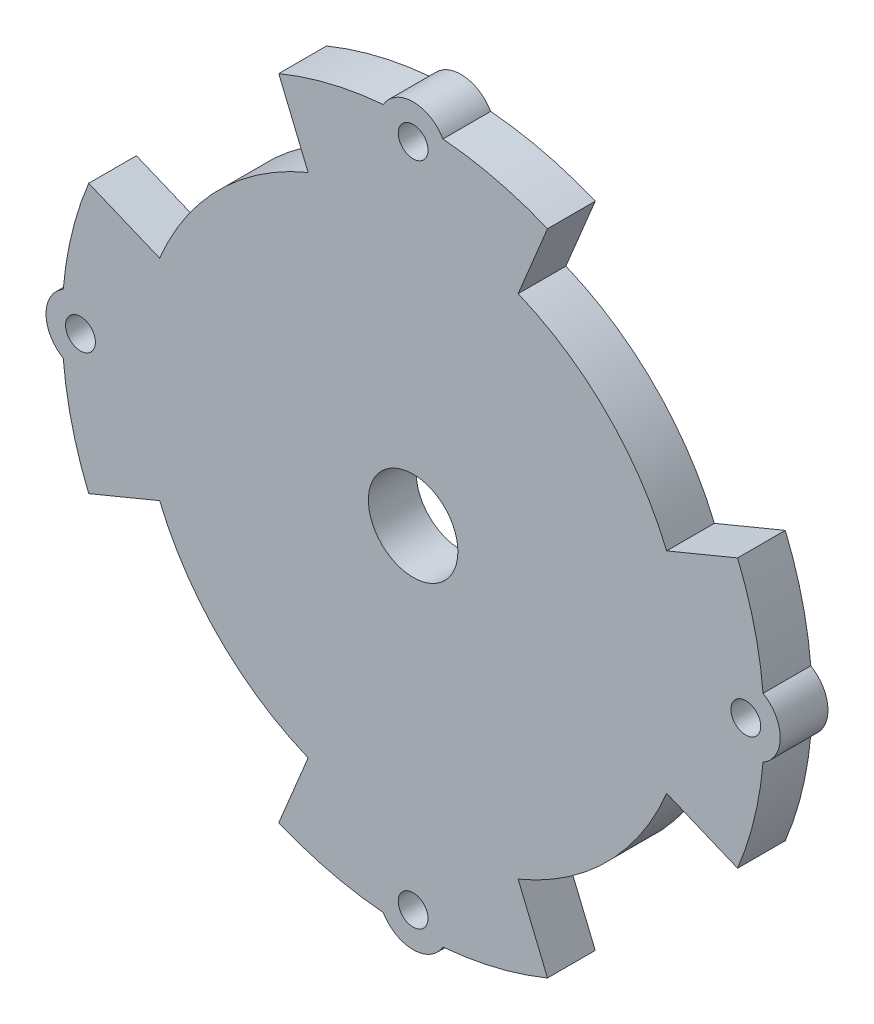
ISO-10303-21;
HEADER;
FILE_DESCRIPTION(('STEP AP214'),'2;1');
FILE_NAME('part.step','',(''),(''),'','','');
FILE_SCHEMA(('AUTOMOTIVE_DESIGN { 1 0 10303 214 1 1 1 1 }'));
ENDSEC;
DATA;
#1=APPLICATION_CONTEXT('core data for automotive mechanical design processes');
#2=APPLICATION_PROTOCOL_DEFINITION('international standard','automotive_design',2000,#1);
#3=PRODUCT_CONTEXT('',#1,'mechanical');
#4=PRODUCT('Part','Part','',(#3));
#5=PRODUCT_RELATED_PRODUCT_CATEGORY('part','',(#4));
#6=PRODUCT_DEFINITION_FORMATION('','',#4);
#7=PRODUCT_DEFINITION_CONTEXT('part definition',#1,'design');
#8=PRODUCT_DEFINITION('design','',#6,#7);
#9=PRODUCT_DEFINITION_SHAPE('','',#8);
#10=(LENGTH_UNIT() NAMED_UNIT(*) SI_UNIT(.MILLI.,.METRE.));
#11=(NAMED_UNIT(*) PLANE_ANGLE_UNIT() SI_UNIT($,.RADIAN.));
#12=(NAMED_UNIT(*) SI_UNIT($,.STERADIAN.) SOLID_ANGLE_UNIT());
#13=UNCERTAINTY_MEASURE_WITH_UNIT(LENGTH_MEASURE(1.E-05),#10,'distance_accuracy_value','');
#14=(GEOMETRIC_REPRESENTATION_CONTEXT(3) GLOBAL_UNCERTAINTY_ASSIGNED_CONTEXT((#13)) GLOBAL_UNIT_ASSIGNED_CONTEXT((#10,
#11,#12)) REPRESENTATION_CONTEXT('',''));
#15=CARTESIAN_POINT('',(0.,0.,0.));
#16=DIRECTION('',(0.,0.,1.));
#17=DIRECTION('',(1.,0.,0.));
#18=AXIS2_PLACEMENT_3D('',#15,#16,#17);
#19=CARTESIAN_POINT('',(0.,0.,4.));
#20=DIRECTION('',(0.,0.,-1.));
#21=DIRECTION('',(-1.,0.,0.));
#22=AXIS2_PLACEMENT_3D('',#19,#20,#21);
#23=CYLINDRICAL_SURFACE('',#22,23.);
#24=CARTESIAN_POINT('',(0.,0.,0.));
#25=DIRECTION('',(0.,0.,1.));
#26=DIRECTION('',(1.,0.,0.));
#27=AXIS2_PLACEMENT_3D('',#24,#25,#26);
#28=CIRCLE('',#27,23.);
#29=CARTESIAN_POINT('',(-8.80171894439731,-21.2492292477595,0.));
#30=VERTEX_POINT('',#29);
#31=CARTESIAN_POINT('',(-21.2492292477597,-8.80171894439696,0.));
#32=VERTEX_POINT('',#31);
#33=EDGE_CURVE('E258',#30,#32,#28,.F.);
#34=ORIENTED_EDGE('',*,*,#33,.F.);
#35=DIRECTION('',(0.,0.,-1.));
#36=VECTOR('',#35,1.);
#37=CARTESIAN_POINT('',(-8.80171894439731,-21.2492292477595,4.));
#38=LINE('',#37,#36);
#39=CARTESIAN_POINT('',(-8.80171894439731,-21.2492292477595,4.));
#40=VERTEX_POINT('',#39);
#41=EDGE_CURVE('E11',#40,#30,#38,.T.);
#42=ORIENTED_EDGE('',*,*,#41,.F.);
#43=CARTESIAN_POINT('',(0.,0.,4.));
#44=DIRECTION('',(0.,0.,1.));
#45=DIRECTION('',(1.,0.,0.));
#46=AXIS2_PLACEMENT_3D('',#43,#44,#45);
#47=CIRCLE('',#46,23.);
#48=CARTESIAN_POINT('',(-21.2492292477597,-8.80171894439696,4.));
#49=VERTEX_POINT('',#48);
#50=EDGE_CURVE('E349',#40,#49,#47,.F.);
#51=ORIENTED_EDGE('',*,*,#50,.T.);
#52=DIRECTION('',(0.,0.,-1.));
#53=VECTOR('',#52,1.);
#54=CARTESIAN_POINT('',(-21.2492292477597,-8.80171894439696,4.));
#55=LINE('',#54,#53);
#56=EDGE_CURVE('E138',#49,#32,#55,.T.);
#57=ORIENTED_EDGE('',*,*,#56,.T.);
#58=EDGE_LOOP('',(#34,#42,#51,#57));
#59=FACE_BOUND('',#58,.T.);
#60=ADVANCED_FACE('F39',(#59),#23,.T.);
#61=CARTESIAN_POINT('',(0.,0.,4.));
#62=DIRECTION('',(-0.923879532511282,0.3826834323651,0.));
#63=DIRECTION('',(-0.3826834323651,-0.923879532511282,0.));
#64=AXIS2_PLACEMENT_3D('',#61,#62,#63);
#65=PLANE('',#64);
#66=DIRECTION('',(0.3826834323651,0.923879532511282,0.));
#67=VECTOR('',#66,1.);
#68=CARTESIAN_POINT('',(0.,0.,0.));
#69=LINE('',#68,#67);
#70=CARTESIAN_POINT('',(-11.2648531781581,-27.1957613208502,0.));
#71=VERTEX_POINT('',#70);
#72=EDGE_CURVE('E262',#71,#30,#69,.T.);
#73=ORIENTED_EDGE('',*,*,#72,.F.);
#74=DIRECTION('',(0.,0.,-1.));
#75=VECTOR('',#74,1.);
#76=CARTESIAN_POINT('',(-11.2648531781581,-27.1957613208502,4.));
#77=LINE('',#76,#75);
#78=CARTESIAN_POINT('',(-11.2648531781581,-27.1957613208502,4.));
#79=VERTEX_POINT('',#78);
#80=EDGE_CURVE('E48',#79,#71,#77,.T.);
#81=ORIENTED_EDGE('',*,*,#80,.F.);
#82=DIRECTION('',(0.3826834323651,0.923879532511282,0.));
#83=VECTOR('',#82,1.);
#84=CARTESIAN_POINT('',(0.,0.,4.));
#85=LINE('',#84,#83);
#86=EDGE_CURVE('E428',#79,#40,#85,.T.);
#87=ORIENTED_EDGE('',*,*,#86,.T.);
#88=ORIENTED_EDGE('',*,*,#41,.T.);
#89=EDGE_LOOP('',(#73,#81,#87,#88));
#90=FACE_BOUND('',#89,.T.);
#91=ADVANCED_FACE('F427',(#90),#65,.T.);
#92=CARTESIAN_POINT('',(0.,0.,4.));
#93=DIRECTION('',(0.,0.,-1.));
#94=DIRECTION('',(-1.,0.,0.));
#95=AXIS2_PLACEMENT_3D('',#92,#93,#94);
#96=CYLINDRICAL_SURFACE('',#95,29.4364799347019);
#97=CARTESIAN_POINT('',(0.,0.,0.));
#98=DIRECTION('',(0.,0.,1.));
#99=DIRECTION('',(1.,0.,0.));
#100=AXIS2_PLACEMENT_3D('',#97,#98,#99);
#101=CIRCLE('',#100,29.4364799347019);
#102=CARTESIAN_POINT('',(-2.50000000000024,-29.3301270189222,0.));
#103=VERTEX_POINT('',#102);
#104=EDGE_CURVE('E266',#71,#103,#101,.T.);
#105=ORIENTED_EDGE('',*,*,#104,.T.);
#106=DIRECTION('',(0.,0.,-1.));
#107=VECTOR('',#106,1.);
#108=CARTESIAN_POINT('',(-2.50000000000024,-29.3301270189222,4.));
#109=LINE('',#108,#107);
#110=CARTESIAN_POINT('',(-2.50000000000024,-29.3301270189222,4.));
#111=VERTEX_POINT('',#110);
#112=EDGE_CURVE('E410',#111,#103,#109,.T.);
#113=ORIENTED_EDGE('',*,*,#112,.F.);
#114=CARTESIAN_POINT('',(0.,0.,4.));
#115=DIRECTION('',(0.,0.,1.));
#116=DIRECTION('',(1.,0.,0.));
#117=AXIS2_PLACEMENT_3D('',#114,#115,#116);
#118=CIRCLE('',#117,29.4364799347019);
#119=EDGE_CURVE('E222',#79,#111,#118,.T.);
#120=ORIENTED_EDGE('',*,*,#119,.F.);
#121=ORIENTED_EDGE('',*,*,#80,.T.);
#122=EDGE_LOOP('',(#105,#113,#120,#121));
#123=FACE_BOUND('',#122,.T.);
#124=ADVANCED_FACE('F416',(#123),#96,.T.);
#125=CARTESIAN_POINT('',(-1.94732143850673E-13,-27.8867513459481,4.));
#126=DIRECTION('',(0.,0.,-1.));
#127=DIRECTION('',(-1.,0.,0.));
#128=AXIS2_PLACEMENT_3D('',#125,#126,#127);
#129=CYLINDRICAL_SURFACE('',#128,2.88675134594813);
#130=CARTESIAN_POINT('',(-1.94732143850673E-13,-27.8867513459481,0.));
#131=DIRECTION('',(0.,0.,1.));
#132=DIRECTION('',(1.,0.,0.));
#133=AXIS2_PLACEMENT_3D('',#130,#131,#132);
#134=CIRCLE('',#133,2.88675134594813);
#135=CARTESIAN_POINT('',(2.49999999999983,-29.3301270189222,0.));
#136=VERTEX_POINT('',#135);
#137=EDGE_CURVE('E270',#136,#103,#134,.F.);
#138=ORIENTED_EDGE('',*,*,#137,.F.);
#139=DIRECTION('',(0.,0.,-1.));
#140=VECTOR('',#139,1.);
#141=CARTESIAN_POINT('',(2.49999999999983,-29.3301270189222,4.));
#142=LINE('',#141,#140);
#143=CARTESIAN_POINT('',(2.49999999999983,-29.3301270189222,4.));
#144=VERTEX_POINT('',#143);
#145=EDGE_CURVE('E407',#144,#136,#142,.T.);
#146=ORIENTED_EDGE('',*,*,#145,.F.);
#147=CARTESIAN_POINT('',(-1.94732143850673E-13,-27.8867513459481,4.));
#148=DIRECTION('',(0.,0.,1.));
#149=DIRECTION('',(1.,0.,0.));
#150=AXIS2_PLACEMENT_3D('',#147,#148,#149);
#151=CIRCLE('',#150,2.88675134594813);
#152=EDGE_CURVE('E438',#144,#111,#151,.F.);
#153=ORIENTED_EDGE('',*,*,#152,.T.);
#154=ORIENTED_EDGE('',*,*,#112,.T.);
#155=EDGE_LOOP('',(#138,#146,#153,#154));
#156=FACE_BOUND('',#155,.T.);
#157=ADVANCED_FACE('F586',(#156),#129,.T.);
#158=CARTESIAN_POINT('',(11.2648531781578,-27.1957613208503,0.));
#159=VERTEX_POINT('',#158);
#160=EDGE_CURVE('E271',#136,#159,#101,.T.);
#161=ORIENTED_EDGE('',*,*,#160,.T.);
#162=DIRECTION('',(0.,0.,-1.));
#163=VECTOR('',#162,1.);
#164=CARTESIAN_POINT('',(11.2648531781578,-27.1957613208503,4.));
#165=LINE('',#164,#163);
#166=CARTESIAN_POINT('',(11.2648531781578,-27.1957613208503,4.));
#167=VERTEX_POINT('',#166);
#168=EDGE_CURVE('E403',#167,#159,#165,.T.);
#169=ORIENTED_EDGE('',*,*,#168,.F.);
#170=EDGE_CURVE('E439',#144,#167,#118,.T.);
#171=ORIENTED_EDGE('',*,*,#170,.F.);
#172=ORIENTED_EDGE('',*,*,#145,.T.);
#173=EDGE_LOOP('',(#161,#169,#171,#172));
#174=FACE_BOUND('',#173,.T.);
#175=ADVANCED_FACE('F523',(#174),#96,.T.);
#176=CARTESIAN_POINT('',(0.,0.,4.));
#177=DIRECTION('',(-0.923879532511287,-0.382683432365088,0.));
#178=DIRECTION('',(0.382683432365089,-0.923879532511288,0.));
#179=AXIS2_PLACEMENT_3D('',#176,#177,#178);
#180=PLANE('',#179);
#181=DIRECTION('',(-0.382683432365088,0.923879532511288,0.));
#182=VECTOR('',#181,1.);
#183=CARTESIAN_POINT('',(0.,0.,0.));
#184=LINE('',#183,#182);
#185=CARTESIAN_POINT('',(8.80171894439704,-21.2492292477596,0.));
#186=VERTEX_POINT('',#185);
#187=EDGE_CURVE('E275',#159,#186,#184,.T.);
#188=ORIENTED_EDGE('',*,*,#187,.T.);
#189=DIRECTION('',(0.,0.,-1.));
#190=VECTOR('',#189,1.);
#191=CARTESIAN_POINT('',(8.80171894439704,-21.2492292477596,4.));
#192=LINE('',#191,#190);
#193=CARTESIAN_POINT('',(8.80171894439704,-21.2492292477596,4.));
#194=VERTEX_POINT('',#193);
#195=EDGE_CURVE('E400',#194,#186,#192,.T.);
#196=ORIENTED_EDGE('',*,*,#195,.F.);
#197=DIRECTION('',(-0.382683432365088,0.923879532511288,0.));
#198=VECTOR('',#197,1.);
#199=CARTESIAN_POINT('',(0.,0.,4.));
#200=LINE('',#199,#198);
#201=EDGE_CURVE('E443',#167,#194,#200,.T.);
#202=ORIENTED_EDGE('',*,*,#201,.F.);
#203=ORIENTED_EDGE('',*,*,#168,.T.);
#204=EDGE_LOOP('',(#188,#196,#202,#203));
#205=FACE_BOUND('',#204,.T.);
#206=ADVANCED_FACE('F528',(#205),#180,.F.);
#207=CARTESIAN_POINT('',(0.,0.,4.));
#208=DIRECTION('',(0.,0.,-1.));
#209=DIRECTION('',(-1.,0.,0.));
#210=AXIS2_PLACEMENT_3D('',#207,#208,#209);
#211=CYLINDRICAL_SURFACE('',#210,23.);
#212=CARTESIAN_POINT('',(0.,0.,0.));
#213=DIRECTION('',(0.,0.,1.));
#214=DIRECTION('',(1.,0.,0.));
#215=AXIS2_PLACEMENT_3D('',#212,#213,#214);
#216=CIRCLE('',#215,23.);
#217=CARTESIAN_POINT('',(21.2492292477595,-8.80171894439724,0.));
#218=VERTEX_POINT('',#217);
#219=EDGE_CURVE('E279',#218,#186,#216,.F.);
#220=ORIENTED_EDGE('',*,*,#219,.F.);
#221=DIRECTION('',(0.,0.,-1.));
#222=VECTOR('',#221,1.);
#223=CARTESIAN_POINT('',(21.2492292477595,-8.80171894439724,4.));
#224=LINE('',#223,#222);
#225=CARTESIAN_POINT('',(21.2492292477595,-8.80171894439724,4.));
#226=VERTEX_POINT('',#225);
#227=EDGE_CURVE('E397',#226,#218,#224,.T.);
#228=ORIENTED_EDGE('',*,*,#227,.F.);
#229=CARTESIAN_POINT('',(0.,0.,4.));
#230=DIRECTION('',(0.,0.,1.));
#231=DIRECTION('',(1.,0.,0.));
#232=AXIS2_PLACEMENT_3D('',#229,#230,#231);
#233=CIRCLE('',#232,23.);
#234=EDGE_CURVE('E446',#226,#194,#233,.F.);
#235=ORIENTED_EDGE('',*,*,#234,.T.);
#236=ORIENTED_EDGE('',*,*,#195,.T.);
#237=EDGE_LOOP('',(#220,#228,#235,#236));
#238=FACE_BOUND('',#237,.T.);
#239=ADVANCED_FACE('F533',(#238),#211,.T.);
#240=CARTESIAN_POINT('',(0.,0.,4.));
#241=DIRECTION('',(-0.382683432365097,-0.923879532511284,0.));
#242=DIRECTION('',(0.923879532511284,-0.382683432365097,0.));
#243=AXIS2_PLACEMENT_3D('',#240,#241,#242);
#244=PLANE('',#243);
#245=DIRECTION('',(-0.923879532511284,0.382683432365097,0.));
#246=VECTOR('',#245,1.);
#247=CARTESIAN_POINT('',(0.,0.,0.));
#248=LINE('',#247,#246);
#249=CARTESIAN_POINT('',(27.1957613208502,-11.2648531781581,0.));
#250=VERTEX_POINT('',#249);
#251=EDGE_CURVE('E283',#250,#218,#248,.T.);
#252=ORIENTED_EDGE('',*,*,#251,.F.);
#253=DIRECTION('',(0.,0.,-1.));
#254=VECTOR('',#253,1.);
#255=CARTESIAN_POINT('',(27.1957613208502,-11.2648531781581,4.));
#256=LINE('',#255,#254);
#257=CARTESIAN_POINT('',(27.1957613208502,-11.2648531781581,4.));
#258=VERTEX_POINT('',#257);
#259=EDGE_CURVE('E394',#258,#250,#256,.T.);
#260=ORIENTED_EDGE('',*,*,#259,.F.);
#261=DIRECTION('',(-0.923879532511284,0.382683432365097,0.));
#262=VECTOR('',#261,1.);
#263=CARTESIAN_POINT('',(0.,0.,4.));
#264=LINE('',#263,#262);
#265=EDGE_CURVE('E450',#258,#226,#264,.T.);
#266=ORIENTED_EDGE('',*,*,#265,.T.);
#267=ORIENTED_EDGE('',*,*,#227,.T.);
#268=EDGE_LOOP('',(#252,#260,#266,#267));
#269=FACE_BOUND('',#268,.T.);
#270=ADVANCED_FACE('F537',(#269),#244,.T.);
#271=CARTESIAN_POINT('',(29.3301270189222,-2.50000000000014,0.));
#272=VERTEX_POINT('',#271);
#273=EDGE_CURVE('E287',#250,#272,#101,.T.);
#274=ORIENTED_EDGE('',*,*,#273,.T.);
#275=DIRECTION('',(0.,0.,-1.));
#276=VECTOR('',#275,1.);
#277=CARTESIAN_POINT('',(29.3301270189222,-2.50000000000014,4.));
#278=LINE('',#277,#276);
#279=CARTESIAN_POINT('',(29.3301270189222,-2.50000000000014,4.));
#280=VERTEX_POINT('',#279);
#281=EDGE_CURVE('E391',#280,#272,#278,.T.);
#282=ORIENTED_EDGE('',*,*,#281,.F.);
#283=EDGE_CURVE('E454',#258,#280,#118,.T.);
#284=ORIENTED_EDGE('',*,*,#283,.F.);
#285=ORIENTED_EDGE('',*,*,#259,.T.);
#286=EDGE_LOOP('',(#274,#282,#284,#285));
#287=FACE_BOUND('',#286,.T.);
#288=ADVANCED_FACE('F539',(#287),#96,.T.);
#289=CARTESIAN_POINT('',(27.8867513459481,0.,4.));
#290=DIRECTION('',(0.,0.,-1.));
#291=DIRECTION('',(-1.,0.,0.));
#292=AXIS2_PLACEMENT_3D('',#289,#290,#291);
#293=CYLINDRICAL_SURFACE('',#292,2.88675134594813);
#294=CARTESIAN_POINT('',(27.8867513459481,0.,0.));
#295=DIRECTION('',(0.,0.,1.));
#296=DIRECTION('',(1.,0.,0.));
#297=AXIS2_PLACEMENT_3D('',#294,#295,#296);
#298=CIRCLE('',#297,2.88675134594813);
#299=CARTESIAN_POINT('',(29.3301270189222,2.49999999999993,0.));
#300=VERTEX_POINT('',#299);
#301=EDGE_CURVE('E288',#300,#272,#298,.F.);
#302=ORIENTED_EDGE('',*,*,#301,.F.);
#303=DIRECTION('',(0.,0.,-1.));
#304=VECTOR('',#303,1.);
#305=CARTESIAN_POINT('',(29.3301270189222,2.49999999999993,4.));
#306=LINE('',#305,#304);
#307=CARTESIAN_POINT('',(29.3301270189222,2.49999999999993,4.));
#308=VERTEX_POINT('',#307);
#309=EDGE_CURVE('E388',#308,#300,#306,.T.);
#310=ORIENTED_EDGE('',*,*,#309,.F.);
#311=CARTESIAN_POINT('',(27.8867513459481,0.,4.));
#312=DIRECTION('',(0.,0.,1.));
#313=DIRECTION('',(1.,0.,0.));
#314=AXIS2_PLACEMENT_3D('',#311,#312,#313);
#315=CIRCLE('',#314,2.88675134594813);
#316=EDGE_CURVE('E455',#308,#280,#315,.F.);
#317=ORIENTED_EDGE('',*,*,#316,.T.);
#318=ORIENTED_EDGE('',*,*,#281,.T.);
#319=EDGE_LOOP('',(#302,#310,#317,#318));
#320=FACE_BOUND('',#319,.T.);
#321=ADVANCED_FACE('F569',(#320),#293,.T.);
#322=CARTESIAN_POINT('',(27.1957613208503,11.2648531781579,0.));
#323=VERTEX_POINT('',#322);
#324=EDGE_CURVE('E292',#300,#323,#101,.T.);
#325=ORIENTED_EDGE('',*,*,#324,.T.);
#326=DIRECTION('',(0.,0.,-1.));
#327=VECTOR('',#326,1.);
#328=CARTESIAN_POINT('',(27.1957613208503,11.2648531781579,4.));
#329=LINE('',#328,#327);
#330=CARTESIAN_POINT('',(27.1957613208503,11.2648531781579,4.));
#331=VERTEX_POINT('',#330);
#332=EDGE_CURVE('E384',#331,#323,#329,.T.);
#333=ORIENTED_EDGE('',*,*,#332,.F.);
#334=EDGE_CURVE('E459',#308,#331,#118,.T.);
#335=ORIENTED_EDGE('',*,*,#334,.F.);
#336=ORIENTED_EDGE('',*,*,#309,.T.);
#337=EDGE_LOOP('',(#325,#333,#335,#336));
#338=FACE_BOUND('',#337,.T.);
#339=ADVANCED_FACE('F567',(#338),#96,.T.);
#340=CARTESIAN_POINT('',(0.,0.,4.));
#341=DIRECTION('',(0.382683432365091,-0.923879532511286,0.));
#342=DIRECTION('',(0.923879532511286,0.382683432365091,0.));
#343=AXIS2_PLACEMENT_3D('',#340,#341,#342);
#344=PLANE('',#343);
#345=DIRECTION('',(-0.923879532511286,-0.382683432365091,0.));
#346=VECTOR('',#345,1.);
#347=CARTESIAN_POINT('',(0.,0.,0.));
#348=LINE('',#347,#346);
#349=CARTESIAN_POINT('',(21.2492292477596,8.8017189443971,0.));
#350=VERTEX_POINT('',#349);
#351=EDGE_CURVE('E293',#323,#350,#348,.T.);
#352=ORIENTED_EDGE('',*,*,#351,.T.);
#353=DIRECTION('',(0.,0.,-1.));
#354=VECTOR('',#353,1.);
#355=CARTESIAN_POINT('',(21.2492292477596,8.8017189443971,4.));
#356=LINE('',#355,#354);
#357=CARTESIAN_POINT('',(21.2492292477596,8.8017189443971,4.));
#358=VERTEX_POINT('',#357);
#359=EDGE_CURVE('E381',#358,#350,#356,.T.);
#360=ORIENTED_EDGE('',*,*,#359,.F.);
#361=DIRECTION('',(-0.923879532511286,-0.382683432365091,0.));
#362=VECTOR('',#361,1.);
#363=CARTESIAN_POINT('',(0.,0.,4.));
#364=LINE('',#363,#362);
#365=EDGE_CURVE('E460',#331,#358,#364,.T.);
#366=ORIENTED_EDGE('',*,*,#365,.F.);
#367=ORIENTED_EDGE('',*,*,#332,.T.);
#368=EDGE_LOOP('',(#352,#360,#366,#367));
#369=FACE_BOUND('',#368,.T.);
#370=ADVANCED_FACE('F565',(#369),#344,.F.);
#371=CARTESIAN_POINT('',(0.,0.,4.));
#372=DIRECTION('',(0.,0.,-1.));
#373=DIRECTION('',(-1.,0.,0.));
#374=AXIS2_PLACEMENT_3D('',#371,#372,#373);
#375=CYLINDRICAL_SURFACE('',#374,23.);
#376=CARTESIAN_POINT('',(0.,0.,0.));
#377=DIRECTION('',(0.,0.,1.));
#378=DIRECTION('',(1.,0.,0.));
#379=AXIS2_PLACEMENT_3D('',#376,#377,#378);
#380=CIRCLE('',#379,23.);
#381=CARTESIAN_POINT('',(8.80171894439717,21.2492292477596,0.));
#382=VERTEX_POINT('',#381);
#383=EDGE_CURVE('E297',#382,#350,#380,.F.);
#384=ORIENTED_EDGE('',*,*,#383,.F.);
#385=DIRECTION('',(0.,0.,-1.));
#386=VECTOR('',#385,1.);
#387=CARTESIAN_POINT('',(8.80171894439717,21.2492292477596,4.));
#388=LINE('',#387,#386);
#389=CARTESIAN_POINT('',(8.80171894439717,21.2492292477596,4.));
#390=VERTEX_POINT('',#389);
#391=EDGE_CURVE('E378',#390,#382,#388,.T.);
#392=ORIENTED_EDGE('',*,*,#391,.F.);
#393=CARTESIAN_POINT('',(0.,0.,4.));
#394=DIRECTION('',(0.,0.,1.));
#395=DIRECTION('',(1.,0.,0.));
#396=AXIS2_PLACEMENT_3D('',#393,#394,#395);
#397=CIRCLE('',#396,23.);
#398=EDGE_CURVE('E463',#390,#358,#397,.F.);
#399=ORIENTED_EDGE('',*,*,#398,.T.);
#400=ORIENTED_EDGE('',*,*,#359,.T.);
#401=EDGE_LOOP('',(#384,#392,#399,#400));
#402=FACE_BOUND('',#401,.T.);
#403=ADVANCED_FACE('F560',(#402),#375,.T.);
#404=CARTESIAN_POINT('',(0.,0.,4.));
#405=DIRECTION('',(0.923879532511285,-0.382683432365094,0.));
#406=DIRECTION('',(0.382683432365094,0.923879532511285,0.));
#407=AXIS2_PLACEMENT_3D('',#404,#405,#406);
#408=PLANE('',#407);
#409=DIRECTION('',(-0.382683432365094,-0.923879532511285,0.));
#410=VECTOR('',#409,1.);
#411=CARTESIAN_POINT('',(0.,0.,0.));
#412=LINE('',#411,#410);
#413=CARTESIAN_POINT('',(11.264853178158,27.1957613208502,0.));
#414=VERTEX_POINT('',#413);
#415=EDGE_CURVE('E301',#414,#382,#412,.T.);
#416=ORIENTED_EDGE('',*,*,#415,.F.);
#417=DIRECTION('',(0.,0.,-1.));
#418=VECTOR('',#417,1.);
#419=CARTESIAN_POINT('',(11.264853178158,27.1957613208502,4.));
#420=LINE('',#419,#418);
#421=CARTESIAN_POINT('',(11.264853178158,27.1957613208502,4.));
#422=VERTEX_POINT('',#421);
#423=EDGE_CURVE('E375',#422,#414,#420,.T.);
#424=ORIENTED_EDGE('',*,*,#423,.F.);
#425=DIRECTION('',(-0.382683432365094,-0.923879532511285,0.));
#426=VECTOR('',#425,1.);
#427=CARTESIAN_POINT('',(0.,0.,4.));
#428=LINE('',#427,#426);
#429=EDGE_CURVE('E467',#422,#390,#428,.T.);
#430=ORIENTED_EDGE('',*,*,#429,.T.);
#431=ORIENTED_EDGE('',*,*,#391,.T.);
#432=EDGE_LOOP('',(#416,#424,#430,#431));
#433=FACE_BOUND('',#432,.T.);
#434=ADVANCED_FACE('F557',(#433),#408,.T.);
#435=CARTESIAN_POINT('',(2.50000000000004,29.3301270189222,0.));
#436=VERTEX_POINT('',#435);
#437=EDGE_CURVE('E305',#414,#436,#101,.T.);
#438=ORIENTED_EDGE('',*,*,#437,.T.);
#439=DIRECTION('',(0.,0.,-1.));
#440=VECTOR('',#439,1.);
#441=CARTESIAN_POINT('',(2.50000000000004,29.3301270189222,4.));
#442=LINE('',#441,#440);
#443=CARTESIAN_POINT('',(2.50000000000004,29.3301270189222,4.));
#444=VERTEX_POINT('',#443);
#445=EDGE_CURVE('E372',#444,#436,#442,.T.);
#446=ORIENTED_EDGE('',*,*,#445,.F.);
#447=EDGE_CURVE('E471',#422,#444,#118,.T.);
#448=ORIENTED_EDGE('',*,*,#447,.F.);
#449=ORIENTED_EDGE('',*,*,#423,.T.);
#450=EDGE_LOOP('',(#438,#446,#448,#449));
#451=FACE_BOUND('',#450,.T.);
#452=ADVANCED_FACE('F550',(#451),#96,.T.);
#453=CARTESIAN_POINT('',(0.,27.8867513459481,4.));
#454=DIRECTION('',(0.,0.,-1.));
#455=DIRECTION('',(-1.,0.,0.));
#456=AXIS2_PLACEMENT_3D('',#453,#454,#455);
#457=CYLINDRICAL_SURFACE('',#456,2.88675134594813);
#458=CARTESIAN_POINT('',(0.,27.8867513459481,0.));
#459=DIRECTION('',(0.,0.,1.));
#460=DIRECTION('',(1.,0.,0.));
#461=AXIS2_PLACEMENT_3D('',#458,#459,#460);
#462=CIRCLE('',#461,2.88675134594813);
#463=CARTESIAN_POINT('',(-2.50000000000004,29.3301270189222,0.));
#464=VERTEX_POINT('',#463);
#465=EDGE_CURVE('E306',#464,#436,#462,.F.);
#466=ORIENTED_EDGE('',*,*,#465,.F.);
#467=DIRECTION('',(0.,0.,-1.));
#468=VECTOR('',#467,1.);
#469=CARTESIAN_POINT('',(-2.50000000000004,29.3301270189222,4.));
#470=LINE('',#469,#468);
#471=CARTESIAN_POINT('',(-2.50000000000004,29.3301270189222,4.));
#472=VERTEX_POINT('',#471);
#473=EDGE_CURVE('E369',#472,#464,#470,.T.);
#474=ORIENTED_EDGE('',*,*,#473,.F.);
#475=CARTESIAN_POINT('',(0.,27.8867513459481,4.));
#476=DIRECTION('',(0.,0.,1.));
#477=DIRECTION('',(1.,0.,0.));
#478=AXIS2_PLACEMENT_3D('',#475,#476,#477);
#479=CIRCLE('',#478,2.88675134594813);
#480=EDGE_CURVE('E472',#472,#444,#479,.F.);
#481=ORIENTED_EDGE('',*,*,#480,.T.);
#482=ORIENTED_EDGE('',*,*,#445,.T.);
#483=EDGE_LOOP('',(#466,#474,#481,#482));
#484=FACE_BOUND('',#483,.T.);
#485=ADVANCED_FACE('F553',(#484),#457,.T.);
#486=CARTESIAN_POINT('',(-11.264853178158,27.1957613208502,0.));
#487=VERTEX_POINT('',#486);
#488=EDGE_CURVE('E310',#464,#487,#101,.T.);
#489=ORIENTED_EDGE('',*,*,#488,.T.);
#490=DIRECTION('',(0.,0.,-1.));
#491=VECTOR('',#490,1.);
#492=CARTESIAN_POINT('',(-11.264853178158,27.1957613208502,4.));
#493=LINE('',#492,#491);
#494=CARTESIAN_POINT('',(-11.264853178158,27.1957613208502,4.));
#495=VERTEX_POINT('',#494);
#496=EDGE_CURVE('E365',#495,#487,#493,.T.);
#497=ORIENTED_EDGE('',*,*,#496,.F.);
#498=EDGE_CURVE('E232',#472,#495,#118,.T.);
#499=ORIENTED_EDGE('',*,*,#498,.F.);
#500=ORIENTED_EDGE('',*,*,#473,.T.);
#501=EDGE_LOOP('',(#489,#497,#499,#500));
#502=FACE_BOUND('',#501,.T.);
#503=ADVANCED_FACE('F554',(#502),#96,.T.);
#504=CARTESIAN_POINT('',(0.,0.,4.));
#505=DIRECTION('',(0.923879532511285,0.382683432365095,0.));
#506=DIRECTION('',(-0.382683432365095,0.923879532511285,0.));
#507=AXIS2_PLACEMENT_3D('',#504,#505,#506);
#508=PLANE('',#507);
#509=DIRECTION('',(0.382683432365095,-0.923879532511285,0.));
#510=VECTOR('',#509,1.);
#511=CARTESIAN_POINT('',(0.,0.,0.));
#512=LINE('',#511,#510);
#513=CARTESIAN_POINT('',(-8.80171894439718,21.2492292477596,0.));
#514=VERTEX_POINT('',#513);
#515=EDGE_CURVE('E311',#487,#514,#512,.T.);
#516=ORIENTED_EDGE('',*,*,#515,.T.);
#517=DIRECTION('',(0.,0.,-1.));
#518=VECTOR('',#517,1.);
#519=CARTESIAN_POINT('',(-8.80171894439718,21.2492292477596,4.));
#520=LINE('',#519,#518);
#521=CARTESIAN_POINT('',(-8.80171894439718,21.2492292477596,4.));
#522=VERTEX_POINT('',#521);
#523=EDGE_CURVE('E362',#522,#514,#520,.T.);
#524=ORIENTED_EDGE('',*,*,#523,.F.);
#525=DIRECTION('',(0.382683432365095,-0.923879532511285,0.));
#526=VECTOR('',#525,1.);
#527=CARTESIAN_POINT('',(0.,0.,4.));
#528=LINE('',#527,#526);
#529=EDGE_CURVE('E476',#495,#522,#528,.T.);
#530=ORIENTED_EDGE('',*,*,#529,.F.);
#531=ORIENTED_EDGE('',*,*,#496,.T.);
#532=EDGE_LOOP('',(#516,#524,#530,#531));
#533=FACE_BOUND('',#532,.T.);
#534=ADVANCED_FACE('F495',(#533),#508,.F.);
#535=CARTESIAN_POINT('',(0.,0.,4.));
#536=DIRECTION('',(0.,0.,-1.));
#537=DIRECTION('',(-1.,0.,0.));
#538=AXIS2_PLACEMENT_3D('',#535,#536,#537);
#539=CYLINDRICAL_SURFACE('',#538,23.);
#540=CARTESIAN_POINT('',(0.,0.,0.));
#541=DIRECTION('',(0.,0.,1.));
#542=DIRECTION('',(1.,0.,0.));
#543=AXIS2_PLACEMENT_3D('',#540,#541,#542);
#544=CIRCLE('',#543,23.);
#545=CARTESIAN_POINT('',(-21.2492292477596,8.80171894439709,0.));
#546=VERTEX_POINT('',#545);
#547=EDGE_CURVE('E315',#546,#514,#544,.F.);
#548=ORIENTED_EDGE('',*,*,#547,.F.);
#549=DIRECTION('',(0.,0.,-1.));
#550=VECTOR('',#549,1.);
#551=CARTESIAN_POINT('',(-21.2492292477596,8.80171894439709,4.));
#552=LINE('',#551,#550);
#553=CARTESIAN_POINT('',(-21.2492292477596,8.80171894439709,4.));
#554=VERTEX_POINT('',#553);
#555=EDGE_CURVE('E359',#554,#546,#552,.T.);
#556=ORIENTED_EDGE('',*,*,#555,.F.);
#557=CARTESIAN_POINT('',(0.,0.,4.));
#558=DIRECTION('',(0.,0.,1.));
#559=DIRECTION('',(1.,0.,0.));
#560=AXIS2_PLACEMENT_3D('',#557,#558,#559);
#561=CIRCLE('',#560,23.);
#562=EDGE_CURVE('E478',#554,#522,#561,.F.);
#563=ORIENTED_EDGE('',*,*,#562,.T.);
#564=ORIENTED_EDGE('',*,*,#523,.T.);
#565=EDGE_LOOP('',(#548,#556,#563,#564));
#566=FACE_BOUND('',#565,.T.);
#567=ADVANCED_FACE('F497',(#566),#539,.T.);
#568=CARTESIAN_POINT('',(0.,0.,4.));
#569=DIRECTION('',(0.382683432365091,0.923879532511286,0.));
#570=DIRECTION('',(-0.923879532511286,0.382683432365091,0.));
#571=AXIS2_PLACEMENT_3D('',#568,#569,#570);
#572=PLANE('',#571);
#573=DIRECTION('',(0.923879532511286,-0.382683432365091,0.));
#574=VECTOR('',#573,1.);
#575=CARTESIAN_POINT('',(0.,0.,0.));
#576=LINE('',#575,#574);
#577=CARTESIAN_POINT('',(-27.1957613208503,11.2648531781579,0.));
#578=VERTEX_POINT('',#577);
#579=EDGE_CURVE('E319',#578,#546,#576,.T.);
#580=ORIENTED_EDGE('',*,*,#579,.F.);
#581=DIRECTION('',(0.,0.,-1.));
#582=VECTOR('',#581,1.);
#583=CARTESIAN_POINT('',(-27.1957613208503,11.2648531781579,4.));
#584=LINE('',#583,#582);
#585=CARTESIAN_POINT('',(-27.1957613208503,11.2648531781579,4.));
#586=VERTEX_POINT('',#585);
#587=EDGE_CURVE('E356',#586,#578,#584,.T.);
#588=ORIENTED_EDGE('',*,*,#587,.F.);
#589=DIRECTION('',(0.923879532511286,-0.382683432365091,0.));
#590=VECTOR('',#589,1.);
#591=CARTESIAN_POINT('',(0.,0.,4.));
#592=LINE('',#591,#590);
#593=EDGE_CURVE('E231',#586,#554,#592,.T.);
#594=ORIENTED_EDGE('',*,*,#593,.T.);
#595=ORIENTED_EDGE('',*,*,#555,.T.);
#596=EDGE_LOOP('',(#580,#588,#594,#595));
#597=FACE_BOUND('',#596,.T.);
#598=ADVANCED_FACE('F487',(#597),#572,.T.);
#599=CARTESIAN_POINT('',(-29.3301270189222,2.50000000000034,0.));
#600=VERTEX_POINT('',#599);
#601=EDGE_CURVE('E323',#578,#600,#101,.T.);
#602=ORIENTED_EDGE('',*,*,#601,.T.);
#603=DIRECTION('',(0.,0.,-1.));
#604=VECTOR('',#603,1.);
#605=CARTESIAN_POINT('',(-29.3301270189222,2.50000000000034,4.));
#606=LINE('',#605,#604);
#607=CARTESIAN_POINT('',(-29.3301270189222,2.50000000000034,4.));
#608=VERTEX_POINT('',#607);
#609=EDGE_CURVE('E214',#608,#600,#606,.T.);
#610=ORIENTED_EDGE('',*,*,#609,.F.);
#611=EDGE_CURVE('E221',#586,#608,#118,.T.);
#612=ORIENTED_EDGE('',*,*,#611,.F.);
#613=ORIENTED_EDGE('',*,*,#587,.T.);
#614=EDGE_LOOP('',(#602,#610,#612,#613));
#615=FACE_BOUND('',#614,.T.);
#616=ADVANCED_FACE('F660',(#615),#96,.T.);
#617=CARTESIAN_POINT('',(-27.8867513459481,2.93832939251986E-13,4.));
#618=DIRECTION('',(0.,0.,-1.));
#619=DIRECTION('',(-1.,0.,0.));
#620=AXIS2_PLACEMENT_3D('',#617,#618,#619);
#621=CYLINDRICAL_SURFACE('',#620,2.88675134594813);
#622=CARTESIAN_POINT('',(-27.8867513459481,2.93832939251986E-13,0.));
#623=DIRECTION('',(0.,0.,1.));
#624=DIRECTION('',(1.,0.,0.));
#625=AXIS2_PLACEMENT_3D('',#622,#623,#624);
#626=CIRCLE('',#625,2.88675134594813);
#627=CARTESIAN_POINT('',(-29.3301270189222,-2.49999999999973,0.));
#628=VERTEX_POINT('',#627);
#629=EDGE_CURVE('E212',#628,#600,#626,.F.);
#630=ORIENTED_EDGE('',*,*,#629,.F.);
#631=DIRECTION('',(0.,0.,-1.));
#632=VECTOR('',#631,1.);
#633=CARTESIAN_POINT('',(-29.3301270189222,-2.49999999999973,4.));
#634=LINE('',#633,#632);
#635=CARTESIAN_POINT('',(-29.3301270189222,-2.49999999999973,4.));
#636=VERTEX_POINT('',#635);
#637=EDGE_CURVE('E206',#636,#628,#634,.T.);
#638=ORIENTED_EDGE('',*,*,#637,.F.);
#639=CARTESIAN_POINT('',(-27.8867513459481,2.93832939251986E-13,4.));
#640=DIRECTION('',(0.,0.,1.));
#641=DIRECTION('',(1.,0.,0.));
#642=AXIS2_PLACEMENT_3D('',#639,#640,#641);
#643=CIRCLE('',#642,2.88675134594813);
#644=EDGE_CURVE('E210',#636,#608,#643,.F.);
#645=ORIENTED_EDGE('',*,*,#644,.T.);
#646=ORIENTED_EDGE('',*,*,#609,.T.);
#647=EDGE_LOOP('',(#630,#638,#645,#646));
#648=FACE_BOUND('',#647,.T.);
#649=ADVANCED_FACE('F208',(#648),#621,.T.);
#650=CARTESIAN_POINT('',(-27.1957613208504,-11.2648531781577,0.));
#651=VERTEX_POINT('',#650);
#652=EDGE_CURVE('E131',#628,#651,#101,.T.);
#653=ORIENTED_EDGE('',*,*,#652,.T.);
#654=DIRECTION('',(0.,0.,-1.));
#655=VECTOR('',#654,1.);
#656=CARTESIAN_POINT('',(-27.1957613208504,-11.2648531781577,4.));
#657=LINE('',#656,#655);
#658=CARTESIAN_POINT('',(-27.1957613208504,-11.2648531781577,4.));
#659=VERTEX_POINT('',#658);
#660=EDGE_CURVE('E215',#659,#651,#657,.T.);
#661=ORIENTED_EDGE('',*,*,#660,.F.);
#662=EDGE_CURVE('E217',#636,#659,#118,.T.);
#663=ORIENTED_EDGE('',*,*,#662,.F.);
#664=ORIENTED_EDGE('',*,*,#637,.T.);
#665=EDGE_LOOP('',(#653,#661,#663,#664));
#666=FACE_BOUND('',#665,.T.);
#667=ADVANCED_FACE('F218',(#666),#96,.T.);
#668=CARTESIAN_POINT('',(27.8867513459481,0.,4.));
#669=DIRECTION('',(0.,0.,-1.));
#670=DIRECTION('',(-1.,0.,0.));
#671=AXIS2_PLACEMENT_3D('',#668,#669,#670);
#672=CYLINDRICAL_SURFACE('',#671,1.25);
#673=CARTESIAN_POINT('',(27.8867513459481,0.,4.));
#674=DIRECTION('',(0.,0.,1.));
#675=DIRECTION('',(1.,0.,0.));
#676=AXIS2_PLACEMENT_3D('',#673,#674,#675);
#677=CIRCLE('',#676,1.25);
#678=CARTESIAN_POINT('',(29.1367513459481,0.,4.));
#679=VERTEX_POINT('',#678);
#680=EDGE_CURVE('E250',#679,#679,#677,.T.);
#681=ORIENTED_EDGE('',*,*,#680,.T.);
#682=EDGE_LOOP('',(#681));
#683=FACE_BOUND('',#682,.T.);
#684=CARTESIAN_POINT('',(27.8867513459481,0.,0.));
#685=DIRECTION('',(0.,0.,1.));
#686=DIRECTION('',(1.,0.,0.));
#687=AXIS2_PLACEMENT_3D('',#684,#685,#686);
#688=CIRCLE('',#687,1.25);
#689=CARTESIAN_POINT('',(29.1367513459481,0.,0.));
#690=VERTEX_POINT('',#689);
#691=EDGE_CURVE('E341',#690,#690,#688,.T.);
#692=ORIENTED_EDGE('',*,*,#691,.F.);
#693=EDGE_LOOP('',(#692));
#694=FACE_BOUND('',#693,.T.);
#695=ADVANCED_FACE('F707',(#683,#694),#672,.F.);
#696=CARTESIAN_POINT('',(0.,0.,4.));
#697=DIRECTION('',(0.,0.,-1.));
#698=DIRECTION('',(-1.,0.,0.));
#699=AXIS2_PLACEMENT_3D('',#696,#697,#698);
#700=CYLINDRICAL_SURFACE('',#699,3.75);
#701=CARTESIAN_POINT('',(0.,0.,4.));
#702=DIRECTION('',(0.,0.,1.));
#703=DIRECTION('',(1.,0.,0.));
#704=AXIS2_PLACEMENT_3D('',#701,#702,#703);
#705=CIRCLE('',#704,3.75);
#706=CARTESIAN_POINT('',(3.75,0.,4.));
#707=VERTEX_POINT('',#706);
#708=EDGE_CURVE('E246',#707,#707,#705,.T.);
#709=ORIENTED_EDGE('',*,*,#708,.T.);
#710=EDGE_LOOP('',(#709));
#711=FACE_BOUND('',#710,.T.);
#712=CARTESIAN_POINT('',(0.,0.,0.));
#713=DIRECTION('',(0.,0.,1.));
#714=DIRECTION('',(1.,0.,0.));
#715=AXIS2_PLACEMENT_3D('',#712,#713,#714);
#716=CIRCLE('',#715,3.75);
#717=CARTESIAN_POINT('',(3.75,0.,0.));
#718=VERTEX_POINT('',#717);
#719=EDGE_CURVE('E337',#718,#718,#716,.T.);
#720=ORIENTED_EDGE('',*,*,#719,.F.);
#721=EDGE_LOOP('',(#720));
#722=FACE_BOUND('',#721,.T.);
#723=ADVANCED_FACE('F715',(#711,#722),#700,.F.);
#724=CARTESIAN_POINT('',(-1.94732143850673E-13,-27.8867513459481,4.));
#725=DIRECTION('',(0.,0.,-1.));
#726=DIRECTION('',(-1.,0.,0.));
#727=AXIS2_PLACEMENT_3D('',#724,#725,#726);
#728=CYLINDRICAL_SURFACE('',#727,1.25);
#729=CARTESIAN_POINT('',(-1.94732143850673E-13,-27.8867513459481,4.));
#730=DIRECTION('',(0.,0.,1.));
#731=DIRECTION('',(1.,0.,0.));
#732=AXIS2_PLACEMENT_3D('',#729,#730,#731);
#733=CIRCLE('',#732,1.25);
#734=CARTESIAN_POINT('',(1.24999999999981,-27.8867513459481,4.));
#735=VERTEX_POINT('',#734);
#736=EDGE_CURVE('E242',#735,#735,#733,.T.);
#737=ORIENTED_EDGE('',*,*,#736,.T.);
#738=EDGE_LOOP('',(#737));
#739=FACE_BOUND('',#738,.T.);
#740=CARTESIAN_POINT('',(-1.94732143850673E-13,-27.8867513459481,0.));
#741=DIRECTION('',(0.,0.,1.));
#742=DIRECTION('',(1.,0.,0.));
#743=AXIS2_PLACEMENT_3D('',#740,#741,#742);
#744=CIRCLE('',#743,1.25);
#745=CARTESIAN_POINT('',(1.24999999999981,-27.8867513459481,0.));
#746=VERTEX_POINT('',#745);
#747=EDGE_CURVE('E333',#746,#746,#744,.T.);
#748=ORIENTED_EDGE('',*,*,#747,.F.);
#749=EDGE_LOOP('',(#748));
#750=FACE_BOUND('',#749,.T.);
#751=ADVANCED_FACE('F725',(#739,#750),#728,.F.);
#752=CARTESIAN_POINT('',(-27.8867513459481,2.93832939251986E-13,4.));
#753=DIRECTION('',(0.,0.,-1.));
#754=DIRECTION('',(-1.,0.,0.));
#755=AXIS2_PLACEMENT_3D('',#752,#753,#754);
#756=CYLINDRICAL_SURFACE('',#755,1.25);
#757=CARTESIAN_POINT('',(-27.8867513459481,2.93832939251986E-13,4.));
#758=DIRECTION('',(0.,0.,1.));
#759=DIRECTION('',(1.,0.,0.));
#760=AXIS2_PLACEMENT_3D('',#757,#758,#759);
#761=CIRCLE('',#760,1.25);
#762=CARTESIAN_POINT('',(-26.6367513459481,2.93832939251986E-13,4.));
#763=VERTEX_POINT('',#762);
#764=EDGE_CURVE('E238',#763,#763,#761,.T.);
#765=ORIENTED_EDGE('',*,*,#764,.T.);
#766=EDGE_LOOP('',(#765));
#767=FACE_BOUND('',#766,.T.);
#768=CARTESIAN_POINT('',(-27.8867513459481,2.93832939251986E-13,0.));
#769=DIRECTION('',(0.,0.,1.));
#770=DIRECTION('',(1.,0.,0.));
#771=AXIS2_PLACEMENT_3D('',#768,#769,#770);
#772=CIRCLE('',#771,1.25);
#773=CARTESIAN_POINT('',(-26.6367513459481,2.93832939251986E-13,0.));
#774=VERTEX_POINT('',#773);
#775=EDGE_CURVE('E329',#774,#774,#772,.T.);
#776=ORIENTED_EDGE('',*,*,#775,.F.);
#777=EDGE_LOOP('',(#776));
#778=FACE_BOUND('',#777,.T.);
#779=ADVANCED_FACE('F735',(#767,#778),#756,.F.);
#780=CARTESIAN_POINT('',(0.,0.,4.));
#781=DIRECTION('',(-0.382683432365085,0.923879532511289,0.));
#782=DIRECTION('',(-0.923879532511289,-0.382683432365085,0.));
#783=AXIS2_PLACEMENT_3D('',#780,#781,#782);
#784=PLANE('',#783);
#785=DIRECTION('',(0.923879532511289,0.382683432365085,0.));
#786=VECTOR('',#785,1.);
#787=CARTESIAN_POINT('',(0.,0.,0.));
#788=LINE('',#787,#786);
#789=EDGE_CURVE('E326',#651,#32,#788,.T.);
#790=ORIENTED_EDGE('',*,*,#789,.T.);
#791=ORIENTED_EDGE('',*,*,#56,.F.);
#792=DIRECTION('',(0.923879532511289,0.382683432365085,0.));
#793=VECTOR('',#792,1.);
#794=CARTESIAN_POINT('',(0.,0.,4.));
#795=LINE('',#794,#793);
#796=EDGE_CURVE('E56',#659,#49,#795,.T.);
#797=ORIENTED_EDGE('',*,*,#796,.F.);
#798=ORIENTED_EDGE('',*,*,#660,.T.);
#799=EDGE_LOOP('',(#790,#791,#797,#798));
#800=FACE_BOUND('',#799,.T.);
#801=ADVANCED_FACE('F431',(#800),#784,.F.);
#802=CARTESIAN_POINT('',(0.,27.8867513459481,4.));
#803=DIRECTION('',(0.,0.,-1.));
#804=DIRECTION('',(-1.,0.,0.));
#805=AXIS2_PLACEMENT_3D('',#802,#803,#804);
#806=CYLINDRICAL_SURFACE('',#805,1.25);
#807=CARTESIAN_POINT('',(0.,27.8867513459481,4.));
#808=DIRECTION('',(0.,0.,1.));
#809=DIRECTION('',(1.,0.,0.));
#810=AXIS2_PLACEMENT_3D('',#807,#808,#809);
#811=CIRCLE('',#810,1.25);
#812=CARTESIAN_POINT('',(1.25,27.8867513459481,4.));
#813=VERTEX_POINT('',#812);
#814=EDGE_CURVE('E254',#813,#813,#811,.T.);
#815=ORIENTED_EDGE('',*,*,#814,.T.);
#816=EDGE_LOOP('',(#815));
#817=FACE_BOUND('',#816,.T.);
#818=CARTESIAN_POINT('',(0.,27.8867513459481,0.));
#819=DIRECTION('',(0.,0.,1.));
#820=DIRECTION('',(1.,0.,0.));
#821=AXIS2_PLACEMENT_3D('',#818,#819,#820);
#822=CIRCLE('',#821,1.25);
#823=CARTESIAN_POINT('',(1.25,27.8867513459481,0.));
#824=VERTEX_POINT('',#823);
#825=EDGE_CURVE('E345',#824,#824,#822,.T.);
#826=ORIENTED_EDGE('',*,*,#825,.F.);
#827=EDGE_LOOP('',(#826));
#828=FACE_BOUND('',#827,.T.);
#829=ADVANCED_FACE('F754',(#817,#828),#806,.F.);
#830=CARTESIAN_POINT('',(0.,0.,4.));
#831=DIRECTION('',(0.,0.,1.));
#832=DIRECTION('',(1.,0.,0.));
#833=AXIS2_PLACEMENT_3D('',#830,#831,#832);
#834=PLANE('',#833);
#835=ORIENTED_EDGE('',*,*,#50,.F.);
#836=ORIENTED_EDGE('',*,*,#86,.F.);
#837=ORIENTED_EDGE('',*,*,#119,.T.);
#838=ORIENTED_EDGE('',*,*,#152,.F.);
#839=ORIENTED_EDGE('',*,*,#170,.T.);
#840=ORIENTED_EDGE('',*,*,#201,.T.);
#841=ORIENTED_EDGE('',*,*,#234,.F.);
#842=ORIENTED_EDGE('',*,*,#265,.F.);
#843=ORIENTED_EDGE('',*,*,#283,.T.);
#844=ORIENTED_EDGE('',*,*,#316,.F.);
#845=ORIENTED_EDGE('',*,*,#334,.T.);
#846=ORIENTED_EDGE('',*,*,#365,.T.);
#847=ORIENTED_EDGE('',*,*,#398,.F.);
#848=ORIENTED_EDGE('',*,*,#429,.F.);
#849=ORIENTED_EDGE('',*,*,#447,.T.);
#850=ORIENTED_EDGE('',*,*,#480,.F.);
#851=ORIENTED_EDGE('',*,*,#498,.T.);
#852=ORIENTED_EDGE('',*,*,#529,.T.);
#853=ORIENTED_EDGE('',*,*,#562,.F.);
#854=ORIENTED_EDGE('',*,*,#593,.F.);
#855=ORIENTED_EDGE('',*,*,#611,.T.);
#856=ORIENTED_EDGE('',*,*,#644,.F.);
#857=ORIENTED_EDGE('',*,*,#662,.T.);
#858=ORIENTED_EDGE('',*,*,#796,.T.);
#859=EDGE_LOOP('',(#835,#836,#837,#838,#839,#840,#841,#842,#843,#844,#845,#846,#847,#848,#849,
#850,#851,#852,#853,#854,#855,#856,#857,#858));
#860=FACE_BOUND('',#859,.T.);
#861=ORIENTED_EDGE('',*,*,#764,.F.);
#862=EDGE_LOOP('',(#861));
#863=FACE_BOUND('',#862,.T.);
#864=ORIENTED_EDGE('',*,*,#736,.F.);
#865=EDGE_LOOP('',(#864));
#866=FACE_BOUND('',#865,.T.);
#867=ORIENTED_EDGE('',*,*,#708,.F.);
#868=EDGE_LOOP('',(#867));
#869=FACE_BOUND('',#868,.T.);
#870=ORIENTED_EDGE('',*,*,#680,.F.);
#871=EDGE_LOOP('',(#870));
#872=FACE_BOUND('',#871,.T.);
#873=ORIENTED_EDGE('',*,*,#814,.F.);
#874=EDGE_LOOP('',(#873));
#875=FACE_BOUND('',#874,.T.);
#876=ADVANCED_FACE('F223',(#860,#863,#866,#869,#872,#875),#834,.T.);
#877=CARTESIAN_POINT('',(0.,0.,0.));
#878=DIRECTION('',(0.,0.,1.));
#879=DIRECTION('',(1.,0.,0.));
#880=AXIS2_PLACEMENT_3D('',#877,#878,#879);
#881=PLANE('',#880);
#882=ORIENTED_EDGE('',*,*,#33,.T.);
#883=ORIENTED_EDGE('',*,*,#789,.F.);
#884=ORIENTED_EDGE('',*,*,#652,.F.);
#885=ORIENTED_EDGE('',*,*,#629,.T.);
#886=ORIENTED_EDGE('',*,*,#601,.F.);
#887=ORIENTED_EDGE('',*,*,#579,.T.);
#888=ORIENTED_EDGE('',*,*,#547,.T.);
#889=ORIENTED_EDGE('',*,*,#515,.F.);
#890=ORIENTED_EDGE('',*,*,#488,.F.);
#891=ORIENTED_EDGE('',*,*,#465,.T.);
#892=ORIENTED_EDGE('',*,*,#437,.F.);
#893=ORIENTED_EDGE('',*,*,#415,.T.);
#894=ORIENTED_EDGE('',*,*,#383,.T.);
#895=ORIENTED_EDGE('',*,*,#351,.F.);
#896=ORIENTED_EDGE('',*,*,#324,.F.);
#897=ORIENTED_EDGE('',*,*,#301,.T.);
#898=ORIENTED_EDGE('',*,*,#273,.F.);
#899=ORIENTED_EDGE('',*,*,#251,.T.);
#900=ORIENTED_EDGE('',*,*,#219,.T.);
#901=ORIENTED_EDGE('',*,*,#187,.F.);
#902=ORIENTED_EDGE('',*,*,#160,.F.);
#903=ORIENTED_EDGE('',*,*,#137,.T.);
#904=ORIENTED_EDGE('',*,*,#104,.F.);
#905=ORIENTED_EDGE('',*,*,#72,.T.);
#906=EDGE_LOOP('',(#882,#883,#884,#885,#886,#887,#888,#889,#890,#891,#892,#893,#894,#895,#896,
#897,#898,#899,#900,#901,#902,#903,#904,#905));
#907=FACE_BOUND('',#906,.T.);
#908=ORIENTED_EDGE('',*,*,#775,.T.);
#909=EDGE_LOOP('',(#908));
#910=FACE_BOUND('',#909,.T.);
#911=ORIENTED_EDGE('',*,*,#747,.T.);
#912=EDGE_LOOP('',(#911));
#913=FACE_BOUND('',#912,.T.);
#914=ORIENTED_EDGE('',*,*,#719,.T.);
#915=EDGE_LOOP('',(#914));
#916=FACE_BOUND('',#915,.T.);
#917=ORIENTED_EDGE('',*,*,#691,.T.);
#918=EDGE_LOOP('',(#917));
#919=FACE_BOUND('',#918,.T.);
#920=ORIENTED_EDGE('',*,*,#825,.T.);
#921=EDGE_LOOP('',(#920));
#922=FACE_BOUND('',#921,.T.);
#923=ADVANCED_FACE('F423',(#907,#910,#913,#916,#919,#922),#881,.F.);
#924=CLOSED_SHELL('',(#60,#91,#124,#157,#175,#206,#239,#270,#288,#321,#339,#370,#403,#434,#452,
#485,#503,#534,#567,#598,#616,#649,#667,#695,#723,#751,#779,#801,#829,#876,#923));
#925=MANIFOLD_SOLID_BREP('B2',#924);
#926=ADVANCED_BREP_SHAPE_REPRESENTATION('',(#18,#925),#14);
#927=SHAPE_DEFINITION_REPRESENTATION(#9,#926);
ENDSEC;
END-ISO-10303-21;
